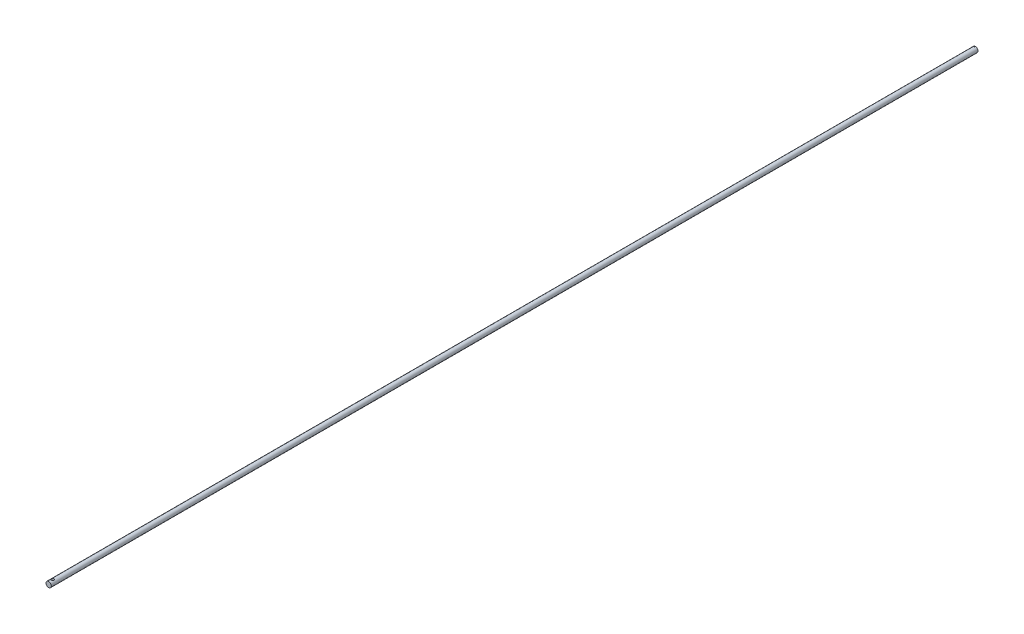
ISO-10303-21;
HEADER;
FILE_DESCRIPTION(('STEP AP214'),'2;1');
FILE_NAME('part.step','',(''),(''),'','','');
FILE_SCHEMA(('AUTOMOTIVE_DESIGN { 1 0 10303 214 1 1 1 1 }'));
ENDSEC;
DATA;
#1=APPLICATION_CONTEXT('core data for automotive mechanical design processes');
#2=APPLICATION_PROTOCOL_DEFINITION('international standard','automotive_design',2000,#1);
#3=PRODUCT_CONTEXT('',#1,'mechanical');
#4=PRODUCT('Part','Part','',(#3));
#5=PRODUCT_RELATED_PRODUCT_CATEGORY('part','',(#4));
#6=PRODUCT_DEFINITION_FORMATION('','',#4);
#7=PRODUCT_DEFINITION_CONTEXT('part definition',#1,'design');
#8=PRODUCT_DEFINITION('design','',#6,#7);
#9=PRODUCT_DEFINITION_SHAPE('','',#8);
#10=(LENGTH_UNIT() NAMED_UNIT(*) SI_UNIT(.MILLI.,.METRE.));
#11=(NAMED_UNIT(*) PLANE_ANGLE_UNIT() SI_UNIT($,.RADIAN.));
#12=(NAMED_UNIT(*) SI_UNIT($,.STERADIAN.) SOLID_ANGLE_UNIT());
#13=UNCERTAINTY_MEASURE_WITH_UNIT(LENGTH_MEASURE(1.E-05),#10,'distance_accuracy_value','');
#14=(GEOMETRIC_REPRESENTATION_CONTEXT(3) GLOBAL_UNCERTAINTY_ASSIGNED_CONTEXT((#13)) GLOBAL_UNIT_ASSIGNED_CONTEXT((#10,
#11,#12)) REPRESENTATION_CONTEXT('',''));
#15=CARTESIAN_POINT('',(0.,0.,0.));
#16=DIRECTION('',(0.,0.,1.));
#17=DIRECTION('',(1.,0.,0.));
#18=AXIS2_PLACEMENT_3D('',#15,#16,#17);
#19=CARTESIAN_POINT('',(0.,0.,847.09));
#20=DIRECTION('',(0.,0.,-1.));
#21=DIRECTION('',(-1.,0.,0.));
#22=AXIS2_PLACEMENT_3D('',#19,#20,#21);
#23=CYLINDRICAL_SURFACE('',#22,2.413);
#24=CARTESIAN_POINT('',(0.,-2.413,1.0166605428782));
#25=CARTESIAN_POINT('',(0.015720959245022,-2.41299979330764,1.0166598699224));
#26=CARTESIAN_POINT('',(0.0314519527569609,-2.4128447380917,1.0153363049519));
#27=CARTESIAN_POINT('',(0.0624767949548955,-2.41224110485342,1.01007690139139));
#28=CARTESIAN_POINT('',(0.0777701597862083,-2.41179221412301,1.00613827971992));
#29=CARTESIAN_POINT('',(0.107466058997746,-2.41065151735598,0.995765863687046));
#30=CARTESIAN_POINT('',(0.121869163425646,-2.4099598686965,0.989333685587385));
#31=CARTESIAN_POINT('',(0.149388541405434,-2.40841073322655,0.974160136932));
#32=CARTESIAN_POINT('',(0.162505047991892,-2.40755327653191,0.965419185615037));
#33=CARTESIAN_POINT('',(0.187144803899487,-2.40576376954713,0.945831261403639));
#34=CARTESIAN_POINT('',(0.1986609869831,-2.40483141543459,0.934975426731647));
#35=CARTESIAN_POINT('',(0.219712378260813,-2.40299966807161,0.911484886900904));
#36=CARTESIAN_POINT('',(0.229247489055841,-2.40210027644356,0.898850094331211));
#37=CARTESIAN_POINT('',(0.246091959960271,-2.40043326434412,0.872114936521105));
#38=CARTESIAN_POINT('',(0.253394775757225,-2.39966603414021,0.8580104216138));
#39=CARTESIAN_POINT('',(0.265525567240454,-2.39835414901133,0.828764810518573));
#40=CARTESIAN_POINT('',(0.270353624626206,-2.39780948673882,0.813623748569004));
#41=CARTESIAN_POINT('',(0.277376549164859,-2.39700726218767,0.782807781129286));
#42=CARTESIAN_POINT('',(0.279583280844481,-2.3967484066818,0.76713561379648));
#43=CARTESIAN_POINT('',(0.281337612315652,-2.39654312963609,0.735641401641122));
#44=CARTESIAN_POINT('',(0.280885305346123,-2.39659669714116,0.719819362093246));
#45=CARTESIAN_POINT('',(0.277344152294966,-2.39700903065825,0.688556887659552));
#46=CARTESIAN_POINT('',(0.274268332820679,-2.39736628871659,0.673114954523678));
#47=CARTESIAN_POINT('',(0.265587770247209,-2.3983433968623,0.642967944136945));
#48=CARTESIAN_POINT('',(0.259982982154741,-2.39896325162156,0.628262880001012));
#49=CARTESIAN_POINT('',(0.246389441560889,-2.4003974315983,0.59996631031291));
#50=CARTESIAN_POINT('',(0.238394984656643,-2.40121222120713,0.586377569625292));
#51=CARTESIAN_POINT('',(0.220253126849021,-2.40294409494175,0.56072966275034));
#52=CARTESIAN_POINT('',(0.210105640502792,-2.40386118312656,0.548670557296851));
#53=CARTESIAN_POINT('',(0.187873372319823,-2.40570103252839,0.526348591771989));
#54=CARTESIAN_POINT('',(0.175777354089551,-2.4066237948331,0.516096919709446));
#55=CARTESIAN_POINT('',(0.15003019248698,-2.40836586691069,0.497767793942995));
#56=CARTESIAN_POINT('',(0.136379046290799,-2.4091851764957,0.489690344187241));
#57=CARTESIAN_POINT('',(0.107900829421248,-2.41062844461109,0.475939112676047));
#58=CARTESIAN_POINT('',(0.0930734412891221,-2.41125235017706,0.47026598246639));
#59=CARTESIAN_POINT('',(0.0626676618981668,-2.41223401435497,0.461493058969842));
#60=CARTESIAN_POINT('',(0.0470893011353241,-2.41259178376466,0.458393161280432));
#61=CARTESIAN_POINT('',(0.0157205811110129,-2.4129994678356,0.45486908479761));
#62=CARTESIAN_POINT('',(-6.80234840193251E-05,-2.41305115680706,0.454429484265625));
#63=CARTESIAN_POINT('',(-0.0314939609789752,-2.41284563458181,0.456197853786154));
#64=CARTESIAN_POINT('',(-0.0471312966588511,-2.41258842907274,0.458405775090165));
#65=CARTESIAN_POINT('',(-0.0777656709320841,-2.41179513243127,0.465393707856193));
#66=CARTESIAN_POINT('',(-0.0927643980122575,-2.41125983346073,0.470166414731849));
#67=CARTESIAN_POINT('',(-0.121748495462242,-2.40997032269198,0.482140877088735));
#68=CARTESIAN_POINT('',(-0.135733835622254,-2.40921610437098,0.489342704947664));
#69=CARTESIAN_POINT('',(-0.162363356527693,-2.40756851504939,0.506008631289766));
#70=CARTESIAN_POINT('',(-0.175001219407397,-2.40667453318473,0.515482763322728));
#71=CARTESIAN_POINT('',(-0.19851288481525,-2.40484946801226,0.53641009739474));
#72=CARTESIAN_POINT('',(-0.209386626883218,-2.40391838343423,0.547863367235293));
#73=CARTESIAN_POINT('',(-0.229115672328427,-2.40211862627979,0.572491560300268));
#74=CARTESIAN_POINT('',(-0.237960789718913,-2.40125028304107,0.585674670801704));
#75=CARTESIAN_POINT('',(-0.253311264707548,-2.39967960280498,0.613348357617467));
#76=CARTESIAN_POINT('',(-0.259816663868122,-2.39897726285883,0.627838910700846));
#77=CARTESIAN_POINT('',(-0.270286339154354,-2.39782029441065,0.657682524001085));
#78=CARTESIAN_POINT('',(-0.274256474851512,-2.39736509507811,0.673033505510802));
#79=CARTESIAN_POINT('',(-0.279561850821293,-2.39675226504568,0.704189842590432));
#80=CARTESIAN_POINT('',(-0.280897196178528,-2.3965946224782,0.719995180013542));
#81=CARTESIAN_POINT('',(-0.280893331724679,-2.39659506738281,0.751510277539973));
#82=CARTESIAN_POINT('',(-0.279570122975788,-2.39675126593689,0.767220042051229));
#83=CARTESIAN_POINT('',(-0.274320472410866,-2.39735774499996,0.798192349779264));
#84=CARTESIAN_POINT('',(-0.270394029231554,-2.39780802566296,0.813454892761834));
#85=CARTESIAN_POINT('',(-0.2600541598841,-2.398951371969,0.843098124304184));
#86=CARTESIAN_POINT('',(-0.253641395903441,-2.39964437296303,0.857479046487972));
#87=CARTESIAN_POINT('',(-0.238512508744422,-2.40119519262413,0.884963170645523));
#88=CARTESIAN_POINT('',(-0.229796371940739,-2.40205301226616,0.898066365060415));
#89=CARTESIAN_POINT('',(-0.210248480292888,-2.40384300493042,0.922704984280119));
#90=CARTESIAN_POINT('',(-0.199404790905168,-2.40477557897569,0.934230911784173));
#91=CARTESIAN_POINT('',(-0.175934193621193,-2.40660641028254,0.95530591616014));
#92=CARTESIAN_POINT('',(-0.163306863609693,-2.40750465935667,0.964854523757854));
#93=CARTESIAN_POINT('',(-0.136580012959953,-2.40916886729257,0.981730200009411));
#94=CARTESIAN_POINT('',(-0.122475746785153,-2.409934377344,0.989049792765039));
#95=CARTESIAN_POINT('',(-0.0932376480360676,-2.41124221486812,1.00120644287852));
#96=CARTESIAN_POINT('',(-0.0781049707086269,-2.41178478809684,1.00604623532441));
#97=CARTESIAN_POINT('',(-0.0524093236934649,-2.41245277262133,1.01192949648491));
#98=CARTESIAN_POINT('',(-0.042009262294057,-2.41265699904941,1.01370113597057));
#99=CARTESIAN_POINT('',(-0.021074303324472,-2.41293068161219,1.01606688115848));
#100=CARTESIAN_POINT('',(-0.0105394065757373,-2.41300013856755,1.01666099403101));
#101=CARTESIAN_POINT('',(0.,-2.413,1.0166605428782));
#102=B_SPLINE_CURVE_WITH_KNOTS('',3,(#24,#25,#26,#27,#28,#29,#30,#31,#32,#33,#34,#35,#36,#37,
#38,#39,#40,#41,#42,#43,#44,#45,#46,#47,#48,#49,#50,#51,#52,#53,#54,#55,#56,#57,#58,#59,#60,#61,
#62,#63,#64,#65,#66,#67,#68,#69,#70,#71,#72,#73,#74,#75,#76,#77,#78,#79,#80,#81,#82,#83,#84,#85,
#86,#87,#88,#89,#90,#91,#92,#93,#94,#95,#96,#97,#98,#99,#100,#101),.UNSPECIFIED.,.T.,.F.,(4,2,2,
2,2,2,2,2,2,2,2,2,2,2,2,2,2,2,2,2,2,2,2,2,2,2,2,2,2,2,2,2,2,2,2,2,2,2,4),(0.,0.0471243848153435,
0.0942990024517486,0.14144309365255,0.188578630068176,0.235916095140211,0.28325588699995,
0.330733160272876,0.378208866072275,0.425468860604847,0.472727197980368,0.519752239031073,
0.566778116744776,0.613917159264317,0.661058072844129,0.708481258889733,0.755904531050208,
0.803340646223444,0.850774836700036,0.897933785791328,0.945091866563859,0.992116346041126,
1.03914222677603,1.08637970619061,1.13361880419248,1.181090141954,1.2285606363997,
1.27592101478718,1.32327950423969,1.37035381062627,1.41742814166511,1.46448994389292,
1.51155202451536,1.55888606471695,1.60623132578908,1.65373367243243,1.70118351311587,
1.73277611938143,1.76436853327041),.UNSPECIFIED.);
#103=CARTESIAN_POINT('',(0.,-2.413,1.0166605428782));
#104=VERTEX_POINT('',#103);
#105=EDGE_CURVE('E10',#104,#104,#102,.T.);
#106=ORIENTED_EDGE('',*,*,#105,.T.);
#107=EDGE_LOOP('',(#106));
#108=FACE_BOUND('',#107,.T.);
#109=CARTESIAN_POINT('',(0.,2.413,1.0166605428782));
#110=CARTESIAN_POINT('',(-0.015720959245022,2.41299979330764,1.0166598699224));
#111=CARTESIAN_POINT('',(-0.0314519527569609,2.4128447380917,1.0153363049519));
#112=CARTESIAN_POINT('',(-0.0624767949548955,2.41224110485342,1.01007690139139));
#113=CARTESIAN_POINT('',(-0.0777701597862083,2.41179221412301,1.00613827971992));
#114=CARTESIAN_POINT('',(-0.107466058997746,2.41065151735598,0.995765863687046));
#115=CARTESIAN_POINT('',(-0.121869163425646,2.4099598686965,0.989333685587385));
#116=CARTESIAN_POINT('',(-0.149388541405434,2.40841073322655,0.974160136932));
#117=CARTESIAN_POINT('',(-0.162505047991892,2.40755327653191,0.965419185615037));
#118=CARTESIAN_POINT('',(-0.187144803899487,2.40576376954713,0.945831261403639));
#119=CARTESIAN_POINT('',(-0.1986609869831,2.40483141543459,0.934975426731647));
#120=CARTESIAN_POINT('',(-0.219712378260813,2.40299966807161,0.911484886900904));
#121=CARTESIAN_POINT('',(-0.229247489055841,2.40210027644356,0.898850094331211));
#122=CARTESIAN_POINT('',(-0.246091959960271,2.40043326434412,0.872114936521105));
#123=CARTESIAN_POINT('',(-0.253394775757225,2.39966603414021,0.8580104216138));
#124=CARTESIAN_POINT('',(-0.265525567240454,2.39835414901133,0.828764810518573));
#125=CARTESIAN_POINT('',(-0.270353624626206,2.39780948673882,0.813623748569004));
#126=CARTESIAN_POINT('',(-0.277376549164859,2.39700726218767,0.782807781129286));
#127=CARTESIAN_POINT('',(-0.279583280844481,2.3967484066818,0.76713561379648));
#128=CARTESIAN_POINT('',(-0.281337612315652,2.39654312963609,0.735641401641122));
#129=CARTESIAN_POINT('',(-0.280885305346123,2.39659669714116,0.719819362093246));
#130=CARTESIAN_POINT('',(-0.277344152294966,2.39700903065825,0.688556887659552));
#131=CARTESIAN_POINT('',(-0.274268332820679,2.39736628871659,0.673114954523678));
#132=CARTESIAN_POINT('',(-0.265587770247209,2.3983433968623,0.642967944136945));
#133=CARTESIAN_POINT('',(-0.259982982154741,2.39896325162156,0.628262880001012));
#134=CARTESIAN_POINT('',(-0.246389441560889,2.4003974315983,0.59996631031291));
#135=CARTESIAN_POINT('',(-0.238394984656643,2.40121222120713,0.586377569625292));
#136=CARTESIAN_POINT('',(-0.220253126849021,2.40294409494175,0.56072966275034));
#137=CARTESIAN_POINT('',(-0.210105640502792,2.40386118312656,0.548670557296851));
#138=CARTESIAN_POINT('',(-0.187873372319823,2.40570103252839,0.526348591771989));
#139=CARTESIAN_POINT('',(-0.175777354089551,2.4066237948331,0.516096919709446));
#140=CARTESIAN_POINT('',(-0.15003019248698,2.40836586691069,0.497767793942995));
#141=CARTESIAN_POINT('',(-0.136379046290799,2.4091851764957,0.489690344187241));
#142=CARTESIAN_POINT('',(-0.107900829421248,2.41062844461109,0.475939112676047));
#143=CARTESIAN_POINT('',(-0.0930734412891221,2.41125235017706,0.47026598246639));
#144=CARTESIAN_POINT('',(-0.0626676618981668,2.41223401435497,0.461493058969842));
#145=CARTESIAN_POINT('',(-0.0470893011353241,2.41259178376466,0.458393161280432));
#146=CARTESIAN_POINT('',(-0.0157205811110129,2.4129994678356,0.45486908479761));
#147=CARTESIAN_POINT('',(6.80234840193251E-05,2.41305115680706,0.454429484265625));
#148=CARTESIAN_POINT('',(0.0314939609789752,2.41284563458181,0.456197853786154));
#149=CARTESIAN_POINT('',(0.0471312966588511,2.41258842907274,0.458405775090165));
#150=CARTESIAN_POINT('',(0.0777656709320841,2.41179513243127,0.465393707856193));
#151=CARTESIAN_POINT('',(0.0927643980122575,2.41125983346073,0.470166414731849));
#152=CARTESIAN_POINT('',(0.121748495462242,2.40997032269198,0.482140877088735));
#153=CARTESIAN_POINT('',(0.135733835622254,2.40921610437098,0.489342704947664));
#154=CARTESIAN_POINT('',(0.162363356527693,2.40756851504939,0.506008631289766));
#155=CARTESIAN_POINT('',(0.175001219407397,2.40667453318473,0.515482763322728));
#156=CARTESIAN_POINT('',(0.19851288481525,2.40484946801226,0.53641009739474));
#157=CARTESIAN_POINT('',(0.209386626883218,2.40391838343423,0.547863367235293));
#158=CARTESIAN_POINT('',(0.229115672328427,2.40211862627979,0.572491560300268));
#159=CARTESIAN_POINT('',(0.237960789718913,2.40125028304107,0.585674670801704));
#160=CARTESIAN_POINT('',(0.253311264707548,2.39967960280498,0.613348357617467));
#161=CARTESIAN_POINT('',(0.259816663868122,2.39897726285883,0.627838910700846));
#162=CARTESIAN_POINT('',(0.270286339154354,2.39782029441065,0.657682524001085));
#163=CARTESIAN_POINT('',(0.274256474851512,2.39736509507811,0.673033505510802));
#164=CARTESIAN_POINT('',(0.279561850821293,2.39675226504568,0.704189842590432));
#165=CARTESIAN_POINT('',(0.280897196178528,2.3965946224782,0.719995180013542));
#166=CARTESIAN_POINT('',(0.280893331724679,2.39659506738281,0.751510277539973));
#167=CARTESIAN_POINT('',(0.279570122975788,2.39675126593689,0.767220042051229));
#168=CARTESIAN_POINT('',(0.274320472410866,2.39735774499996,0.798192349779264));
#169=CARTESIAN_POINT('',(0.270394029231554,2.39780802566296,0.813454892761834));
#170=CARTESIAN_POINT('',(0.2600541598841,2.398951371969,0.843098124304184));
#171=CARTESIAN_POINT('',(0.253641395903441,2.39964437296303,0.857479046487972));
#172=CARTESIAN_POINT('',(0.238512508744422,2.40119519262413,0.884963170645523));
#173=CARTESIAN_POINT('',(0.229796371940739,2.40205301226616,0.898066365060415));
#174=CARTESIAN_POINT('',(0.210248480292888,2.40384300493042,0.922704984280119));
#175=CARTESIAN_POINT('',(0.199404790905168,2.40477557897569,0.934230911784173));
#176=CARTESIAN_POINT('',(0.175934193621193,2.40660641028254,0.95530591616014));
#177=CARTESIAN_POINT('',(0.163306863609693,2.40750465935667,0.964854523757854));
#178=CARTESIAN_POINT('',(0.136580012959953,2.40916886729257,0.981730200009411));
#179=CARTESIAN_POINT('',(0.122475746785153,2.409934377344,0.989049792765039));
#180=CARTESIAN_POINT('',(0.0932376480360676,2.41124221486812,1.00120644287852));
#181=CARTESIAN_POINT('',(0.0781049707086269,2.41178478809684,1.00604623532441));
#182=CARTESIAN_POINT('',(0.0524093236934649,2.41245277262133,1.01192949648491));
#183=CARTESIAN_POINT('',(0.042009262294057,2.41265699904941,1.01370113597057));
#184=CARTESIAN_POINT('',(0.021074303324472,2.41293068161219,1.01606688115848));
#185=CARTESIAN_POINT('',(0.0105394065757373,2.41300013856755,1.01666099403101));
#186=CARTESIAN_POINT('',(0.,2.413,1.0166605428782));
#187=B_SPLINE_CURVE_WITH_KNOTS('',3,(#109,#110,#111,#112,#113,#114,#115,#116,#117,#118,#119,
#120,#121,#122,#123,#124,#125,#126,#127,#128,#129,#130,#131,#132,#133,#134,#135,#136,#137,#138,
#139,#140,#141,#142,#143,#144,#145,#146,#147,#148,#149,#150,#151,#152,#153,#154,#155,#156,#157,
#158,#159,#160,#161,#162,#163,#164,#165,#166,#167,#168,#169,#170,#171,#172,#173,#174,#175,#176,
#177,#178,#179,#180,#181,#182,#183,#184,#185,#186),.UNSPECIFIED.,.T.,.F.,(4,2,2,2,2,2,2,2,2,2,2,
2,2,2,2,2,2,2,2,2,2,2,2,2,2,2,2,2,2,2,2,2,2,2,2,2,2,2,4),(0.,0.0471243848153435,
0.0942990024517486,0.14144309365255,0.188578630068176,0.235916095140211,0.28325588699995,
0.330733160272876,0.378208866072275,0.425468860604847,0.472727197980368,0.519752239031073,
0.566778116744776,0.613917159264317,0.661058072844129,0.708481258889733,0.755904531050208,
0.803340646223444,0.850774836700036,0.897933785791328,0.945091866563859,0.992116346041126,
1.03914222677603,1.08637970619061,1.13361880419248,1.181090141954,1.2285606363997,
1.27592101478718,1.32327950423969,1.37035381062627,1.41742814166511,1.46448994389292,
1.51155202451536,1.55888606471695,1.60623132578908,1.65373367243243,1.70118351311587,
1.73277611938143,1.76436853327041),.UNSPECIFIED.);
#188=CARTESIAN_POINT('',(0.,2.413,1.0166605428782));
#189=VERTEX_POINT('',#188);
#190=EDGE_CURVE('E40',#189,#189,#187,.T.);
#191=ORIENTED_EDGE('',*,*,#190,.T.);
#192=EDGE_LOOP('',(#191));
#193=FACE_BOUND('',#192,.T.);
#194=CARTESIAN_POINT('',(0.,-2.413,844.825959397164));
#195=CARTESIAN_POINT('',(0.0663376884113887,-2.41299616761001,844.82595507758));
#196=CARTESIAN_POINT('',(0.132741474178861,-2.4102357929426,844.820731403564));
#197=CARTESIAN_POINT('',(0.26355942000748,-2.39946499358596,844.800080701299));
#198=CARTESIAN_POINT('',(0.327970169098695,-2.39144603895963,844.784637094938));
#199=CARTESIAN_POINT('',(0.452715778500737,-2.3709908901928,844.744331454124));
#200=CARTESIAN_POINT('',(0.513065874078983,-2.35857244585445,844.719507239431));
#201=CARTESIAN_POINT('',(0.628639718597237,-2.33043430822242,844.661355877604));
#202=CARTESIAN_POINT('',(0.683863530786794,-2.31471465566781,844.6280288354));
#203=CARTESIAN_POINT('',(0.791649545684057,-2.28019011153791,844.551371165503));
#204=CARTESIAN_POINT('',(0.843806062578964,-2.26125116273393,844.507531480266));
#205=CARTESIAN_POINT('',(0.94040611716465,-2.22281651146819,844.412200054934));
#206=CARTESIAN_POINT('',(0.984843090255952,-2.20332035140718,844.360701870548));
#207=CARTESIAN_POINT('',(1.06868973164012,-2.16397792107224,844.24608770264));
#208=CARTESIAN_POINT('',(1.10731000176614,-2.14425250937965,844.18234758614));
#209=CARTESIAN_POINT('',(1.17312384139967,-2.10896950287804,844.048151336524));
#210=CARTESIAN_POINT('',(1.2003261257228,-2.09340873269205,843.977700376061));
#211=CARTESIAN_POINT('',(1.24066485175056,-2.06974394768051,843.836490339883));
#212=CARTESIAN_POINT('',(1.25456987700464,-2.06123687815049,843.76602208412));
#213=CARTESIAN_POINT('',(1.27023829435801,-2.05162340061522,843.62328404083));
#214=CARTESIAN_POINT('',(1.2720162391645,-2.05050812237756,843.551016517066));
#215=CARTESIAN_POINT('',(1.26394123055553,-2.05548749285205,843.417334198058));
#216=CARTESIAN_POINT('',(1.25563786191771,-2.06062180612828,843.355780619293));
#217=CARTESIAN_POINT('',(1.23035004172622,-2.07581871082698,843.235115964434));
#218=CARTESIAN_POINT('',(1.21336227078785,-2.0858831866131,843.176005831626));
#219=CARTESIAN_POINT('',(1.17091499326573,-2.11000742200316,843.060228073342));
#220=CARTESIAN_POINT('',(1.14527160492895,-2.12415283866956,843.003646569437));
#221=CARTESIAN_POINT('',(1.08638976871511,-2.15486147690367,842.895305812809));
#222=CARTESIAN_POINT('',(1.05314793214252,-2.17142577603143,842.843548726183));
#223=CARTESIAN_POINT('',(0.974500691675149,-2.20795196210652,842.738560616789));
#224=CARTESIAN_POINT('',(0.928036920576845,-2.22806160914986,842.686170925315));
#225=CARTESIAN_POINT('',(0.826954381749559,-2.2675230618698,842.589554651697));
#226=CARTESIAN_POINT('',(0.772330911819399,-2.28687442239702,842.545332809531));
#227=CARTESIAN_POINT('',(0.652599786087819,-2.32396711940055,842.463923903017));
#228=CARTESIAN_POINT('',(0.587073764057231,-2.34155537867618,842.427276536903));
#229=CARTESIAN_POINT('',(0.44963149519313,-2.37177871024132,842.365840362692));
#230=CARTESIAN_POINT('',(0.377720886092089,-2.38441810016537,842.341041213455));
#231=CARTESIAN_POINT('',(0.236361333740623,-2.40235763877502,842.306217728869));
#232=CARTESIAN_POINT('',(0.167257284123059,-2.40820808137313,842.295080532091));
#233=CARTESIAN_POINT('',(0.0279263891323597,-2.41384328135187,842.284348708131));
#234=CARTESIAN_POINT('',(-0.0422998120485804,-2.41363140214697,842.284747680611));
#235=CARTESIAN_POINT('',(-0.175301838550562,-2.40746400163305,842.296502060151));
#236=CARTESIAN_POINT('',(-0.23819027955424,-2.40201460048098,842.306892044623));
#237=CARTESIAN_POINT('',(-0.361184922089728,-2.38662042091987,842.336758253788));
#238=CARTESIAN_POINT('',(-0.421290829977764,-2.37667516924558,842.356235435072));
#239=CARTESIAN_POINT('',(-0.538840960390834,-2.35285181154011,842.4041413756));
#240=CARTESIAN_POINT('',(-0.596176241611053,-2.33887870309168,842.432788480335));
#241=CARTESIAN_POINT('',(-0.70539730150835,-2.30829057680407,842.49795945518));
#242=CARTESIAN_POINT('',(-0.757280891176377,-2.29167450442037,842.534486471463));
#243=CARTESIAN_POINT('',(-0.859960449231442,-2.25528449618253,842.618816736092));
#244=CARTESIAN_POINT('',(-0.91006084109567,-2.23536244499548,842.667404063054));
#245=CARTESIAN_POINT('',(-1.00174651516619,-2.19580767720552,842.772213131471));
#246=CARTESIAN_POINT('',(-1.04332433289486,-2.17617522809623,842.82844149425));
#247=CARTESIAN_POINT('',(-1.11931656372704,-2.13813436789078,842.951334849225));
#248=CARTESIAN_POINT('',(-1.15311311419325,-2.11988145336974,843.018434595424));
#249=CARTESIAN_POINT('',(-1.20858394967375,-2.08876000714849,843.158611465957));
#250=CARTESIAN_POINT('',(-1.23027522954323,-2.07588393321389,843.231680044347));
#251=CARTESIAN_POINT('',(-1.25880124744409,-2.05869904316081,843.374121710328));
#252=CARTESIAN_POINT('',(-1.26688290205664,-2.05367469734082,843.443155907825));
#253=CARTESIAN_POINT('',(-1.27162625532877,-2.05074331889695,843.581749856187));
#254=CARTESIAN_POINT('',(-1.26829502362657,-2.05283188022422,843.651309255082));
#255=CARTESIAN_POINT('',(-1.25150115696435,-2.06310150661035,843.780435209863));
#256=CARTESIAN_POINT('',(-1.23925536463677,-2.07054968287213,843.840226755861));
#257=CARTESIAN_POINT('',(-1.20660198994232,-2.08974571524352,843.956806483189));
#258=CARTESIAN_POINT('',(-1.18619148955738,-2.10149510845493,844.013593582523));
#259=CARTESIAN_POINT('',(-1.13632261457682,-2.12889576758241,844.126694726926));
#260=CARTESIAN_POINT('',(-1.10635998048828,-2.1447518979703,844.182735160362));
#261=CARTESIAN_POINT('',(-1.03875049830063,-2.17829992145723,844.289367826722));
#262=CARTESIAN_POINT('',(-1.00109951508784,-2.19599279990763,844.339957105326));
#263=CARTESIAN_POINT('',(-0.91304010129191,-2.23417467254935,844.441616199488));
#264=CARTESIAN_POINT('',(-0.861584415909881,-2.2547091421516,844.491766819766));
#265=CARTESIAN_POINT('',(-0.750521950093408,-2.29406971322652,844.582984892455));
#266=CARTESIAN_POINT('',(-0.690910146236377,-2.31289474986355,844.624046705871));
#267=CARTESIAN_POINT('',(-0.563474411531943,-2.3472336870099,844.696519068164));
#268=CARTESIAN_POINT('',(-0.495508958806404,-2.36267304861999,844.727717982797));
#269=CARTESIAN_POINT('',(-0.354306361161426,-2.38791534684845,844.77782026171));
#270=CARTESIAN_POINT('',(-0.281084110794375,-2.39773355219152,844.796756952353));
#271=CARTESIAN_POINT('',(-0.172518027679267,-2.40707029767046,844.81466356218));
#272=CARTESIAN_POINT('',(-0.138195656745183,-2.40928666855064,844.818891974896));
#273=CARTESIAN_POINT('',(-0.0692548671911467,-2.412252533836,844.824541046157));
#274=CARTESIAN_POINT('',(-0.0346364430812113,-2.41300200097955,844.825961652519));
#275=CARTESIAN_POINT('',(0.,-2.413,844.825959397164));
#276=B_SPLINE_CURVE_WITH_KNOTS('',3,(#194,#195,#196,#197,#198,#199,#200,#201,#202,#203,#204,
#205,#206,#207,#208,#209,#210,#211,#212,#213,#214,#215,#216,#217,#218,#219,#220,#221,#222,#223,
#224,#225,#226,#227,#228,#229,#230,#231,#232,#233,#234,#235,#236,#237,#238,#239,#240,#241,#242,
#243,#244,#245,#246,#247,#248,#249,#250,#251,#252,#253,#254,#255,#256,#257,#258,#259,#260,#261,
#262,#263,#264,#265,#266,#267,#268,#269,#270,#271,#272,#273,#274,#275),.UNSPECIFIED.,.T.,.F.,(4,
2,2,2,2,2,2,2,2,2,2,2,2,2,2,2,2,2,2,2,2,2,2,2,2,2,2,2,2,2,2,2,2,2,2,2,2,2,2,2,4),(0.,
0.19887316106242,0.398069714695239,0.596471591700691,0.794871020441657,1.00615351613809,
1.21761481342476,1.44773199325583,1.67767321459566,1.8933351316141,2.10873820498387,
2.29483356217838,2.48100010267746,2.67140052948954,2.86188603581516,3.0795211043302,
3.29728207702383,3.52736583366567,3.7572484043519,3.96679691300526,4.17622916507642,
4.36726619948771,4.55832334850263,4.75431841797063,4.95039188669291,5.16720570251737,
5.38420861039661,5.61490973700179,5.84528615715273,6.05310092422907,6.2607869850801,
6.44444289667337,6.6281645045225,6.82389653700968,7.0197341209146,7.24291617542669,
7.46623631369104,7.69406601486966,7.92127389063788,8.02510824298611,8.12894452502237),.UNSPECIFIED.);
#277=CARTESIAN_POINT('',(0.,-2.413,844.825959397164));
#278=VERTEX_POINT('',#277);
#279=EDGE_CURVE('E44',#278,#278,#276,.T.);
#280=ORIENTED_EDGE('',*,*,#279,.T.);
#281=EDGE_LOOP('',(#280));
#282=FACE_BOUND('',#281,.T.);
#283=CARTESIAN_POINT('',(0.,2.413,844.825959397164));
#284=CARTESIAN_POINT('',(-0.0663376884113887,2.41299616761001,844.82595507758));
#285=CARTESIAN_POINT('',(-0.132741474178861,2.4102357929426,844.820731403564));
#286=CARTESIAN_POINT('',(-0.26355942000748,2.39946499358596,844.800080701299));
#287=CARTESIAN_POINT('',(-0.327970169098695,2.39144603895963,844.784637094938));
#288=CARTESIAN_POINT('',(-0.452715778500737,2.3709908901928,844.744331454124));
#289=CARTESIAN_POINT('',(-0.513065874078983,2.35857244585445,844.719507239431));
#290=CARTESIAN_POINT('',(-0.628639718597237,2.33043430822242,844.661355877604));
#291=CARTESIAN_POINT('',(-0.683863530786794,2.31471465566781,844.6280288354));
#292=CARTESIAN_POINT('',(-0.791649545684057,2.28019011153791,844.551371165503));
#293=CARTESIAN_POINT('',(-0.843806062578964,2.26125116273393,844.507531480266));
#294=CARTESIAN_POINT('',(-0.94040611716465,2.22281651146819,844.412200054934));
#295=CARTESIAN_POINT('',(-0.984843090255952,2.20332035140718,844.360701870548));
#296=CARTESIAN_POINT('',(-1.06868973164012,2.16397792107224,844.24608770264));
#297=CARTESIAN_POINT('',(-1.10731000176614,2.14425250937965,844.18234758614));
#298=CARTESIAN_POINT('',(-1.17312384139967,2.10896950287804,844.048151336524));
#299=CARTESIAN_POINT('',(-1.2003261257228,2.09340873269205,843.977700376061));
#300=CARTESIAN_POINT('',(-1.24066485175056,2.06974394768051,843.836490339883));
#301=CARTESIAN_POINT('',(-1.25456987700464,2.06123687815049,843.76602208412));
#302=CARTESIAN_POINT('',(-1.27023829435801,2.05162340061522,843.62328404083));
#303=CARTESIAN_POINT('',(-1.2720162391645,2.05050812237756,843.551016517066));
#304=CARTESIAN_POINT('',(-1.26394123055553,2.05548749285205,843.417334198058));
#305=CARTESIAN_POINT('',(-1.25563786191771,2.06062180612828,843.355780619293));
#306=CARTESIAN_POINT('',(-1.23035004172622,2.07581871082698,843.235115964434));
#307=CARTESIAN_POINT('',(-1.21336227078785,2.0858831866131,843.176005831626));
#308=CARTESIAN_POINT('',(-1.17091499326573,2.11000742200316,843.060228073342));
#309=CARTESIAN_POINT('',(-1.14527160492895,2.12415283866956,843.003646569437));
#310=CARTESIAN_POINT('',(-1.08638976871511,2.15486147690367,842.895305812809));
#311=CARTESIAN_POINT('',(-1.05314793214252,2.17142577603143,842.843548726183));
#312=CARTESIAN_POINT('',(-0.974500691675149,2.20795196210652,842.738560616789));
#313=CARTESIAN_POINT('',(-0.928036920576845,2.22806160914986,842.686170925315));
#314=CARTESIAN_POINT('',(-0.826954381749559,2.2675230618698,842.589554651697));
#315=CARTESIAN_POINT('',(-0.772330911819399,2.28687442239702,842.545332809531));
#316=CARTESIAN_POINT('',(-0.652599786087819,2.32396711940055,842.463923903017));
#317=CARTESIAN_POINT('',(-0.587073764057231,2.34155537867618,842.427276536903));
#318=CARTESIAN_POINT('',(-0.44963149519313,2.37177871024132,842.365840362692));
#319=CARTESIAN_POINT('',(-0.377720886092089,2.38441810016537,842.341041213455));
#320=CARTESIAN_POINT('',(-0.236361333740623,2.40235763877502,842.306217728869));
#321=CARTESIAN_POINT('',(-0.167257284123059,2.40820808137313,842.295080532091));
#322=CARTESIAN_POINT('',(-0.0279263891323597,2.41384328135187,842.284348708131));
#323=CARTESIAN_POINT('',(0.0422998120485804,2.41363140214697,842.284747680611));
#324=CARTESIAN_POINT('',(0.175301838550562,2.40746400163305,842.296502060151));
#325=CARTESIAN_POINT('',(0.23819027955424,2.40201460048098,842.306892044623));
#326=CARTESIAN_POINT('',(0.361184922089728,2.38662042091987,842.336758253788));
#327=CARTESIAN_POINT('',(0.421290829977764,2.37667516924558,842.356235435072));
#328=CARTESIAN_POINT('',(0.538840960390834,2.35285181154011,842.4041413756));
#329=CARTESIAN_POINT('',(0.596176241611053,2.33887870309168,842.432788480335));
#330=CARTESIAN_POINT('',(0.70539730150835,2.30829057680407,842.49795945518));
#331=CARTESIAN_POINT('',(0.757280891176377,2.29167450442037,842.534486471463));
#332=CARTESIAN_POINT('',(0.859960449231442,2.25528449618253,842.618816736092));
#333=CARTESIAN_POINT('',(0.91006084109567,2.23536244499548,842.667404063054));
#334=CARTESIAN_POINT('',(1.00174651516619,2.19580767720552,842.772213131471));
#335=CARTESIAN_POINT('',(1.04332433289486,2.17617522809623,842.82844149425));
#336=CARTESIAN_POINT('',(1.11931656372704,2.13813436789078,842.951334849225));
#337=CARTESIAN_POINT('',(1.15311311419325,2.11988145336974,843.018434595424));
#338=CARTESIAN_POINT('',(1.20858394967375,2.08876000714849,843.158611465957));
#339=CARTESIAN_POINT('',(1.23027522954323,2.07588393321389,843.231680044347));
#340=CARTESIAN_POINT('',(1.25880124744409,2.05869904316081,843.374121710328));
#341=CARTESIAN_POINT('',(1.26688290205664,2.05367469734082,843.443155907825));
#342=CARTESIAN_POINT('',(1.27162625532877,2.05074331889695,843.581749856187));
#343=CARTESIAN_POINT('',(1.26829502362657,2.05283188022422,843.651309255082));
#344=CARTESIAN_POINT('',(1.25150115696435,2.06310150661035,843.780435209863));
#345=CARTESIAN_POINT('',(1.23925536463677,2.07054968287213,843.840226755861));
#346=CARTESIAN_POINT('',(1.20660198994232,2.08974571524352,843.956806483189));
#347=CARTESIAN_POINT('',(1.18619148955738,2.10149510845493,844.013593582523));
#348=CARTESIAN_POINT('',(1.13632261457682,2.12889576758241,844.126694726926));
#349=CARTESIAN_POINT('',(1.10635998048828,2.1447518979703,844.182735160362));
#350=CARTESIAN_POINT('',(1.03875049830063,2.17829992145723,844.289367826722));
#351=CARTESIAN_POINT('',(1.00109951508784,2.19599279990763,844.339957105326));
#352=CARTESIAN_POINT('',(0.91304010129191,2.23417467254935,844.441616199488));
#353=CARTESIAN_POINT('',(0.861584415909881,2.2547091421516,844.491766819766));
#354=CARTESIAN_POINT('',(0.750521950093408,2.29406971322652,844.582984892455));
#355=CARTESIAN_POINT('',(0.690910146236377,2.31289474986355,844.624046705871));
#356=CARTESIAN_POINT('',(0.563474411531943,2.3472336870099,844.696519068164));
#357=CARTESIAN_POINT('',(0.495508958806404,2.36267304861999,844.727717982797));
#358=CARTESIAN_POINT('',(0.354306361161426,2.38791534684845,844.77782026171));
#359=CARTESIAN_POINT('',(0.281084110794375,2.39773355219152,844.796756952353));
#360=CARTESIAN_POINT('',(0.172518027679267,2.40707029767046,844.81466356218));
#361=CARTESIAN_POINT('',(0.138195656745183,2.40928666855064,844.818891974896));
#362=CARTESIAN_POINT('',(0.0692548671911467,2.412252533836,844.824541046157));
#363=CARTESIAN_POINT('',(0.0346364430812113,2.41300200097955,844.825961652519));
#364=CARTESIAN_POINT('',(0.,2.413,844.825959397164));
#365=B_SPLINE_CURVE_WITH_KNOTS('',3,(#283,#284,#285,#286,#287,#288,#289,#290,#291,#292,#293,
#294,#295,#296,#297,#298,#299,#300,#301,#302,#303,#304,#305,#306,#307,#308,#309,#310,#311,#312,
#313,#314,#315,#316,#317,#318,#319,#320,#321,#322,#323,#324,#325,#326,#327,#328,#329,#330,#331,
#332,#333,#334,#335,#336,#337,#338,#339,#340,#341,#342,#343,#344,#345,#346,#347,#348,#349,#350,
#351,#352,#353,#354,#355,#356,#357,#358,#359,#360,#361,#362,#363,#364),.UNSPECIFIED.,.T.,.F.,(4,
2,2,2,2,2,2,2,2,2,2,2,2,2,2,2,2,2,2,2,2,2,2,2,2,2,2,2,2,2,2,2,2,2,2,2,2,2,2,2,4),(0.,
0.19887316106242,0.398069714695239,0.596471591700691,0.794871020441657,1.00615351613809,
1.21761481342476,1.44773199325583,1.67767321459566,1.8933351316141,2.10873820498387,
2.29483356217838,2.48100010267746,2.67140052948954,2.86188603581516,3.0795211043302,
3.29728207702383,3.52736583366567,3.7572484043519,3.96679691300526,4.17622916507642,
4.36726619948771,4.55832334850263,4.75431841797063,4.95039188669291,5.16720570251737,
5.38420861039661,5.61490973700179,5.84528615715273,6.05310092422907,6.2607869850801,
6.44444289667337,6.6281645045225,6.82389653700968,7.0197341209146,7.24291617542669,
7.46623631369104,7.69406601486966,7.92127389063788,8.02510824298611,8.12894452502237),.UNSPECIFIED.);
#366=CARTESIAN_POINT('',(0.,2.413,844.825959397164));
#367=VERTEX_POINT('',#366);
#368=EDGE_CURVE('E48',#367,#367,#365,.T.);
#369=ORIENTED_EDGE('',*,*,#368,.T.);
#370=EDGE_LOOP('',(#369));
#371=FACE_BOUND('',#370,.T.);
#372=CARTESIAN_POINT('',(0.,0.,847.09));
#373=DIRECTION('',(0.,0.,1.));
#374=DIRECTION('',(1.,0.,0.));
#375=AXIS2_PLACEMENT_3D('',#372,#373,#374);
#376=CIRCLE('',#375,2.413);
#377=CARTESIAN_POINT('',(2.413,0.,847.09));
#378=VERTEX_POINT('',#377);
#379=EDGE_CURVE('E73',#378,#378,#376,.T.);
#380=ORIENTED_EDGE('',*,*,#379,.F.);
#381=EDGE_LOOP('',(#380));
#382=FACE_BOUND('',#381,.T.);
#383=CARTESIAN_POINT('',(0.,0.,0.));
#384=DIRECTION('',(0.,0.,1.));
#385=DIRECTION('',(1.,0.,0.));
#386=AXIS2_PLACEMENT_3D('',#383,#384,#385);
#387=CIRCLE('',#386,2.413);
#388=CARTESIAN_POINT('',(2.413,0.,0.));
#389=VERTEX_POINT('',#388);
#390=EDGE_CURVE('E74',#389,#389,#387,.T.);
#391=ORIENTED_EDGE('',*,*,#390,.T.);
#392=EDGE_LOOP('',(#391));
#393=FACE_BOUND('',#392,.T.);
#394=ADVANCED_FACE('F30',(#108,#193,#282,#371,#382,#393),#23,.T.);
#395=CARTESIAN_POINT('',(0.,0.,847.09));
#396=DIRECTION('',(0.,0.,1.));
#397=DIRECTION('',(1.,0.,0.));
#398=AXIS2_PLACEMENT_3D('',#395,#396,#397);
#399=PLANE('',#398);
#400=ORIENTED_EDGE('',*,*,#379,.T.);
#401=EDGE_LOOP('',(#400));
#402=FACE_BOUND('',#401,.T.);
#403=ADVANCED_FACE('F67',(#402),#399,.T.);
#404=CARTESIAN_POINT('',(0.,0.,0.));
#405=DIRECTION('',(0.,0.,1.));
#406=DIRECTION('',(1.,0.,0.));
#407=AXIS2_PLACEMENT_3D('',#404,#405,#406);
#408=PLANE('',#407);
#409=ORIENTED_EDGE('',*,*,#390,.F.);
#410=EDGE_LOOP('',(#409));
#411=FACE_BOUND('',#410,.T.);
#412=ADVANCED_FACE('F65',(#411),#408,.F.);
#413=CARTESIAN_POINT('',(0.,-2.413,843.555959397164));
#414=DIRECTION('',(0.,1.,0.));
#415=DIRECTION('',(0.,0.,1.));
#416=AXIS2_PLACEMENT_3D('',#413,#414,#415);
#417=CYLINDRICAL_SURFACE('',#416,1.26999999999996);
#418=ORIENTED_EDGE('',*,*,#368,.F.);
#419=EDGE_LOOP('',(#418));
#420=FACE_BOUND('',#419,.T.);
#421=ORIENTED_EDGE('',*,*,#279,.F.);
#422=EDGE_LOOP('',(#421));
#423=FACE_BOUND('',#422,.T.);
#424=ADVANCED_FACE('F59',(#420,#423),#417,.F.);
#425=CARTESIAN_POINT('',(0.,-2.413,0.735765282577461));
#426=DIRECTION('',(0.,1.,0.));
#427=DIRECTION('',(0.,0.,1.));
#428=AXIS2_PLACEMENT_3D('',#425,#426,#427);
#429=CYLINDRICAL_SURFACE('',#428,0.280895260300743);
#430=ORIENTED_EDGE('',*,*,#190,.F.);
#431=EDGE_LOOP('',(#430));
#432=FACE_BOUND('',#431,.T.);
#433=ORIENTED_EDGE('',*,*,#105,.F.);
#434=EDGE_LOOP('',(#433));
#435=FACE_BOUND('',#434,.T.);
#436=ADVANCED_FACE('F56',(#432,#435),#429,.F.);
#437=CLOSED_SHELL('',(#394,#403,#412,#424,#436));
#438=MANIFOLD_SOLID_BREP('B2',#437);
#439=ADVANCED_BREP_SHAPE_REPRESENTATION('',(#18,#438),#14);
#440=SHAPE_DEFINITION_REPRESENTATION(#9,#439);
ENDSEC;
END-ISO-10303-21;
